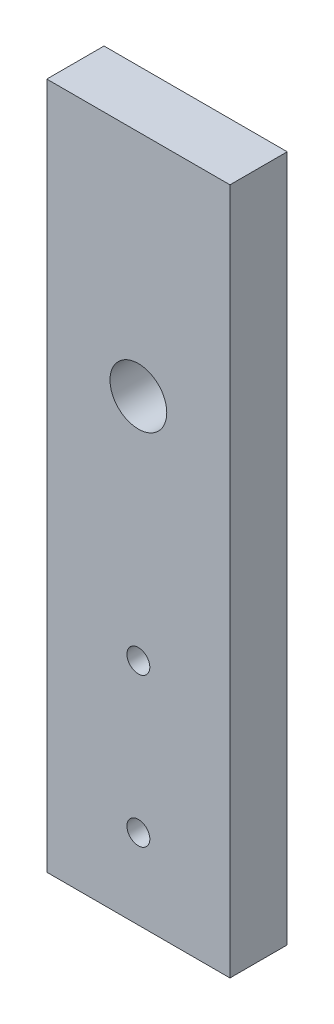
ISO-10303-21;
HEADER;
FILE_DESCRIPTION(('STEP AP214'),'2;1');
FILE_NAME('part.step','',(''),(''),'','','');
FILE_SCHEMA(('AUTOMOTIVE_DESIGN { 1 0 10303 214 1 1 1 1 }'));
ENDSEC;
DATA;
#1=APPLICATION_CONTEXT('core data for automotive mechanical design processes');
#2=APPLICATION_PROTOCOL_DEFINITION('international standard','automotive_design',2000,#1);
#3=PRODUCT_CONTEXT('',#1,'mechanical');
#4=PRODUCT('Part','Part','',(#3));
#5=PRODUCT_RELATED_PRODUCT_CATEGORY('part','',(#4));
#6=PRODUCT_DEFINITION_FORMATION('','',#4);
#7=PRODUCT_DEFINITION_CONTEXT('part definition',#1,'design');
#8=PRODUCT_DEFINITION('design','',#6,#7);
#9=PRODUCT_DEFINITION_SHAPE('','',#8);
#10=(LENGTH_UNIT() NAMED_UNIT(*) SI_UNIT(.MILLI.,.METRE.));
#11=(NAMED_UNIT(*) PLANE_ANGLE_UNIT() SI_UNIT($,.RADIAN.));
#12=(NAMED_UNIT(*) SI_UNIT($,.STERADIAN.) SOLID_ANGLE_UNIT());
#13=UNCERTAINTY_MEASURE_WITH_UNIT(LENGTH_MEASURE(1.E-05),#10,'distance_accuracy_value','');
#14=(GEOMETRIC_REPRESENTATION_CONTEXT(3) GLOBAL_UNCERTAINTY_ASSIGNED_CONTEXT((#13)) GLOBAL_UNIT_ASSIGNED_CONTEXT((#10,
#11,#12)) REPRESENTATION_CONTEXT('',''));
#15=CARTESIAN_POINT('',(0.,0.,0.));
#16=DIRECTION('',(0.,0.,1.));
#17=DIRECTION('',(1.,0.,0.));
#18=AXIS2_PLACEMENT_3D('',#15,#16,#17);
#19=CARTESIAN_POINT('',(0.,0.,-25.));
#20=DIRECTION('',(1.,0.,0.));
#21=DIRECTION('',(0.,1.,0.));
#22=AXIS2_PLACEMENT_3D('',#19,#20,#21);
#23=PLANE('',#22);
#24=DIRECTION('',(0.,1.,0.));
#25=VECTOR('',#24,1.);
#26=CARTESIAN_POINT('',(0.,0.,0.));
#27=LINE('',#26,#25);
#28=CARTESIAN_POINT('',(0.,0.,0.));
#29=VERTEX_POINT('',#28);
#30=CARTESIAN_POINT('',(0.,300.,0.));
#31=VERTEX_POINT('',#30);
#32=EDGE_CURVE('E100',#29,#31,#27,.T.);
#33=ORIENTED_EDGE('',*,*,#32,.F.);
#34=DIRECTION('',(0.,0.,1.));
#35=VECTOR('',#34,1.);
#36=CARTESIAN_POINT('',(0.,0.,-25.));
#37=LINE('',#36,#35);
#38=CARTESIAN_POINT('',(0.,0.,-25.));
#39=VERTEX_POINT('',#38);
#40=EDGE_CURVE('E11',#39,#29,#37,.T.);
#41=ORIENTED_EDGE('',*,*,#40,.F.);
#42=DIRECTION('',(0.,1.,0.));
#43=VECTOR('',#42,1.);
#44=CARTESIAN_POINT('',(0.,0.,-25.));
#45=LINE('',#44,#43);
#46=CARTESIAN_POINT('',(0.,300.,-25.));
#47=VERTEX_POINT('',#46);
#48=EDGE_CURVE('E93',#39,#47,#45,.T.);
#49=ORIENTED_EDGE('',*,*,#48,.T.);
#50=DIRECTION('',(0.,0.,1.));
#51=VECTOR('',#50,1.);
#52=CARTESIAN_POINT('',(0.,300.,-25.));
#53=LINE('',#52,#51);
#54=EDGE_CURVE('E38',#47,#31,#53,.T.);
#55=ORIENTED_EDGE('',*,*,#54,.T.);
#56=EDGE_LOOP('',(#33,#41,#49,#55));
#57=FACE_BOUND('',#56,.T.);
#58=ADVANCED_FACE('F35',(#57),#23,.T.);
#59=CARTESIAN_POINT('',(0.,0.,-25.));
#60=DIRECTION('',(0.,-1.,0.));
#61=DIRECTION('',(0.,0.,-1.));
#62=AXIS2_PLACEMENT_3D('',#59,#60,#61);
#63=PLANE('',#62);
#64=DIRECTION('',(1.,0.,0.));
#65=VECTOR('',#64,1.);
#66=CARTESIAN_POINT('',(0.,0.,0.));
#67=LINE('',#66,#65);
#68=CARTESIAN_POINT('',(-80.,0.,0.));
#69=VERTEX_POINT('',#68);
#70=EDGE_CURVE('E95',#69,#29,#67,.T.);
#71=ORIENTED_EDGE('',*,*,#70,.F.);
#72=DIRECTION('',(0.,0.,1.));
#73=VECTOR('',#72,1.);
#74=CARTESIAN_POINT('',(-80.,0.,-25.));
#75=LINE('',#74,#73);
#76=CARTESIAN_POINT('',(-80.,0.,-25.));
#77=VERTEX_POINT('',#76);
#78=EDGE_CURVE('E44',#77,#69,#75,.T.);
#79=ORIENTED_EDGE('',*,*,#78,.F.);
#80=DIRECTION('',(1.,0.,0.));
#81=VECTOR('',#80,1.);
#82=CARTESIAN_POINT('',(0.,0.,-25.));
#83=LINE('',#82,#81);
#84=EDGE_CURVE('E90',#77,#39,#83,.T.);
#85=ORIENTED_EDGE('',*,*,#84,.T.);
#86=ORIENTED_EDGE('',*,*,#40,.T.);
#87=EDGE_LOOP('',(#71,#79,#85,#86));
#88=FACE_BOUND('',#87,.T.);
#89=ADVANCED_FACE('F111',(#88),#63,.T.);
#90=CARTESIAN_POINT('',(-80.,0.,-25.));
#91=DIRECTION('',(-1.,0.,0.));
#92=DIRECTION('',(0.,-1.,0.));
#93=AXIS2_PLACEMENT_3D('',#90,#91,#92);
#94=PLANE('',#93);
#95=DIRECTION('',(0.,-1.,0.));
#96=VECTOR('',#95,1.);
#97=CARTESIAN_POINT('',(-80.,0.,0.));
#98=LINE('',#97,#96);
#99=CARTESIAN_POINT('',(-80.0000000000001,300.,0.));
#100=VERTEX_POINT('',#99);
#101=EDGE_CURVE('E85',#100,#69,#98,.T.);
#102=ORIENTED_EDGE('',*,*,#101,.F.);
#103=DIRECTION('',(0.,0.,1.));
#104=VECTOR('',#103,1.);
#105=CARTESIAN_POINT('',(-80.0000000000001,300.,-25.));
#106=LINE('',#105,#104);
#107=CARTESIAN_POINT('',(-80.0000000000001,300.,-25.));
#108=VERTEX_POINT('',#107);
#109=EDGE_CURVE('E80',#108,#100,#106,.T.);
#110=ORIENTED_EDGE('',*,*,#109,.F.);
#111=DIRECTION('',(0.,-1.,0.));
#112=VECTOR('',#111,1.);
#113=CARTESIAN_POINT('',(-80.,0.,-25.));
#114=LINE('',#113,#112);
#115=EDGE_CURVE('E83',#108,#77,#114,.T.);
#116=ORIENTED_EDGE('',*,*,#115,.T.);
#117=ORIENTED_EDGE('',*,*,#78,.T.);
#118=EDGE_LOOP('',(#102,#110,#116,#117));
#119=FACE_BOUND('',#118,.T.);
#120=ADVANCED_FACE('F82',(#119),#94,.T.);
#121=CARTESIAN_POINT('',(0.,300.,-25.));
#122=DIRECTION('',(0.,1.,0.));
#123=DIRECTION('',(-1.,0.,0.));
#124=AXIS2_PLACEMENT_3D('',#121,#122,#123);
#125=PLANE('',#124);
#126=DIRECTION('',(-1.,0.,0.));
#127=VECTOR('',#126,1.);
#128=CARTESIAN_POINT('',(0.,300.,0.));
#129=LINE('',#128,#127);
#130=EDGE_CURVE('E103',#31,#100,#129,.T.);
#131=ORIENTED_EDGE('',*,*,#130,.F.);
#132=ORIENTED_EDGE('',*,*,#54,.F.);
#133=DIRECTION('',(-1.,0.,0.));
#134=VECTOR('',#133,1.);
#135=CARTESIAN_POINT('',(0.,300.,-25.));
#136=LINE('',#135,#134);
#137=EDGE_CURVE('E89',#47,#108,#136,.T.);
#138=ORIENTED_EDGE('',*,*,#137,.T.);
#139=ORIENTED_EDGE('',*,*,#109,.T.);
#140=EDGE_LOOP('',(#131,#132,#138,#139));
#141=FACE_BOUND('',#140,.T.);
#142=ADVANCED_FACE('F92',(#141),#125,.T.);
#143=CARTESIAN_POINT('',(0.,0.,-25.));
#144=DIRECTION('',(0.,0.,1.));
#145=DIRECTION('',(1.,0.,0.));
#146=AXIS2_PLACEMENT_3D('',#143,#144,#145);
#147=PLANE('',#146);
#148=CARTESIAN_POINT('',(-40.,100.,-25.));
#149=DIRECTION('',(0.,0.,1.));
#150=DIRECTION('',(1.,0.,0.));
#151=AXIS2_PLACEMENT_3D('',#148,#149,#150);
#152=CIRCLE('',#151,5.00000000000001);
#153=CARTESIAN_POINT('',(-35.,100.,-25.));
#154=VERTEX_POINT('',#153);
#155=EDGE_CURVE('E148',#154,#154,#152,.T.);
#156=ORIENTED_EDGE('',*,*,#155,.T.);
#157=EDGE_LOOP('',(#156));
#158=FACE_BOUND('',#157,.T.);
#159=CARTESIAN_POINT('',(-40.,35.,-25.));
#160=DIRECTION('',(0.,0.,1.));
#161=DIRECTION('',(1.,0.,0.));
#162=AXIS2_PLACEMENT_3D('',#159,#160,#161);
#163=CIRCLE('',#162,5.00000000000001);
#164=CARTESIAN_POINT('',(-35.,35.,-25.));
#165=VERTEX_POINT('',#164);
#166=EDGE_CURVE('E156',#165,#165,#163,.T.);
#167=ORIENTED_EDGE('',*,*,#166,.T.);
#168=EDGE_LOOP('',(#167));
#169=FACE_BOUND('',#168,.T.);
#170=CARTESIAN_POINT('',(-40.,200.,-25.));
#171=DIRECTION('',(0.,0.,1.));
#172=DIRECTION('',(1.,0.,0.));
#173=AXIS2_PLACEMENT_3D('',#170,#171,#172);
#174=CIRCLE('',#173,12.4);
#175=CARTESIAN_POINT('',(-27.6,200.,-25.));
#176=VERTEX_POINT('',#175);
#177=EDGE_CURVE('E104',#176,#176,#174,.T.);
#178=ORIENTED_EDGE('',*,*,#177,.T.);
#179=EDGE_LOOP('',(#178));
#180=FACE_BOUND('',#179,.T.);
#181=ORIENTED_EDGE('',*,*,#48,.F.);
#182=ORIENTED_EDGE('',*,*,#84,.F.);
#183=ORIENTED_EDGE('',*,*,#115,.F.);
#184=ORIENTED_EDGE('',*,*,#137,.F.);
#185=EDGE_LOOP('',(#181,#182,#183,#184));
#186=FACE_BOUND('',#185,.T.);
#187=ADVANCED_FACE('F88',(#158,#169,#180,#186),#147,.F.);
#188=CARTESIAN_POINT('',(0.,0.,0.));
#189=DIRECTION('',(0.,0.,1.));
#190=DIRECTION('',(1.,0.,0.));
#191=AXIS2_PLACEMENT_3D('',#188,#189,#190);
#192=PLANE('',#191);
#193=CARTESIAN_POINT('',(-40.,100.,0.));
#194=DIRECTION('',(0.,0.,1.));
#195=DIRECTION('',(1.,0.,0.));
#196=AXIS2_PLACEMENT_3D('',#193,#194,#195);
#197=CIRCLE('',#196,5.00000000000001);
#198=CARTESIAN_POINT('',(-35.,100.,0.));
#199=VERTEX_POINT('',#198);
#200=EDGE_CURVE('E151',#199,#199,#197,.T.);
#201=ORIENTED_EDGE('',*,*,#200,.F.);
#202=EDGE_LOOP('',(#201));
#203=FACE_BOUND('',#202,.T.);
#204=CARTESIAN_POINT('',(-40.,35.,0.));
#205=DIRECTION('',(0.,0.,1.));
#206=DIRECTION('',(1.,0.,0.));
#207=AXIS2_PLACEMENT_3D('',#204,#205,#206);
#208=CIRCLE('',#207,5.00000000000001);
#209=CARTESIAN_POINT('',(-35.,35.,0.));
#210=VERTEX_POINT('',#209);
#211=EDGE_CURVE('E153',#210,#210,#208,.T.);
#212=ORIENTED_EDGE('',*,*,#211,.F.);
#213=EDGE_LOOP('',(#212));
#214=FACE_BOUND('',#213,.T.);
#215=CARTESIAN_POINT('',(-40.,200.,0.));
#216=DIRECTION('',(0.,0.,1.));
#217=DIRECTION('',(1.,0.,0.));
#218=AXIS2_PLACEMENT_3D('',#215,#216,#217);
#219=CIRCLE('',#218,12.4);
#220=CARTESIAN_POINT('',(-27.6,200.,0.));
#221=VERTEX_POINT('',#220);
#222=EDGE_CURVE('E159',#221,#221,#219,.T.);
#223=ORIENTED_EDGE('',*,*,#222,.F.);
#224=EDGE_LOOP('',(#223));
#225=FACE_BOUND('',#224,.T.);
#226=ORIENTED_EDGE('',*,*,#32,.T.);
#227=ORIENTED_EDGE('',*,*,#130,.T.);
#228=ORIENTED_EDGE('',*,*,#101,.T.);
#229=ORIENTED_EDGE('',*,*,#70,.T.);
#230=EDGE_LOOP('',(#226,#227,#228,#229));
#231=FACE_BOUND('',#230,.T.);
#232=ADVANCED_FACE('F110',(#203,#214,#225,#231),#192,.T.);
#233=CARTESIAN_POINT('',(-40.,200.,-25.));
#234=DIRECTION('',(0.,0.,1.));
#235=DIRECTION('',(1.,0.,0.));
#236=AXIS2_PLACEMENT_3D('',#233,#234,#235);
#237=CYLINDRICAL_SURFACE('',#236,12.4);
#238=ORIENTED_EDGE('',*,*,#177,.F.);
#239=EDGE_LOOP('',(#238));
#240=FACE_BOUND('',#239,.T.);
#241=ORIENTED_EDGE('',*,*,#222,.T.);
#242=EDGE_LOOP('',(#241));
#243=FACE_BOUND('',#242,.T.);
#244=ADVANCED_FACE('F129',(#240,#243),#237,.F.);
#245=CARTESIAN_POINT('',(-40.,35.,-25.));
#246=DIRECTION('',(0.,0.,1.));
#247=DIRECTION('',(1.,0.,0.));
#248=AXIS2_PLACEMENT_3D('',#245,#246,#247);
#249=CYLINDRICAL_SURFACE('',#248,5.00000000000001);
#250=ORIENTED_EDGE('',*,*,#166,.F.);
#251=EDGE_LOOP('',(#250));
#252=FACE_BOUND('',#251,.T.);
#253=ORIENTED_EDGE('',*,*,#211,.T.);
#254=EDGE_LOOP('',(#253));
#255=FACE_BOUND('',#254,.T.);
#256=ADVANCED_FACE('F136',(#252,#255),#249,.F.);
#257=CARTESIAN_POINT('',(-40.,100.,-25.));
#258=DIRECTION('',(0.,0.,1.));
#259=DIRECTION('',(1.,0.,0.));
#260=AXIS2_PLACEMENT_3D('',#257,#258,#259);
#261=CYLINDRICAL_SURFACE('',#260,5.00000000000001);
#262=ORIENTED_EDGE('',*,*,#155,.F.);
#263=EDGE_LOOP('',(#262));
#264=FACE_BOUND('',#263,.T.);
#265=ORIENTED_EDGE('',*,*,#200,.T.);
#266=EDGE_LOOP('',(#265));
#267=FACE_BOUND('',#266,.T.);
#268=ADVANCED_FACE('F140',(#264,#267),#261,.F.);
#269=CLOSED_SHELL('',(#58,#89,#120,#142,#187,#232,#244,#256,#268));
#270=MANIFOLD_SOLID_BREP('B2',#269);
#271=ADVANCED_BREP_SHAPE_REPRESENTATION('',(#18,#270),#14);
#272=SHAPE_DEFINITION_REPRESENTATION(#9,#271);
ENDSEC;
END-ISO-10303-21;
